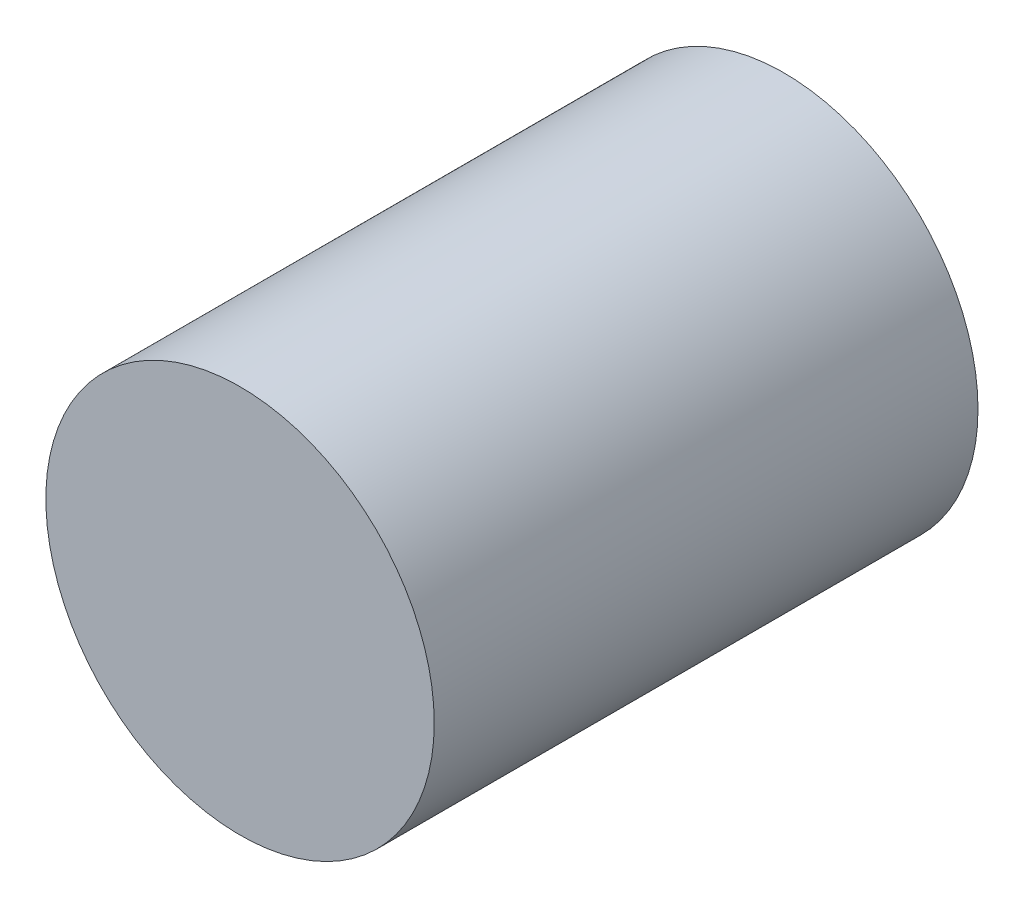
ISO-10303-21;
HEADER;
FILE_DESCRIPTION(('STEP AP214'),'2;1');
FILE_NAME('part.step','',(''),(''),'','','');
FILE_SCHEMA(('AUTOMOTIVE_DESIGN { 1 0 10303 214 1 1 1 1 }'));
ENDSEC;
DATA;
#1=APPLICATION_CONTEXT('core data for automotive mechanical design processes');
#2=APPLICATION_PROTOCOL_DEFINITION('international standard','automotive_design',2000,#1);
#3=PRODUCT_CONTEXT('',#1,'mechanical');
#4=PRODUCT('Part','Part','',(#3));
#5=PRODUCT_RELATED_PRODUCT_CATEGORY('part','',(#4));
#6=PRODUCT_DEFINITION_FORMATION('','',#4);
#7=PRODUCT_DEFINITION_CONTEXT('part definition',#1,'design');
#8=PRODUCT_DEFINITION('design','',#6,#7);
#9=PRODUCT_DEFINITION_SHAPE('','',#8);
#10=(LENGTH_UNIT() NAMED_UNIT(*) SI_UNIT(.MILLI.,.METRE.));
#11=(NAMED_UNIT(*) PLANE_ANGLE_UNIT() SI_UNIT($,.RADIAN.));
#12=(NAMED_UNIT(*) SI_UNIT($,.STERADIAN.) SOLID_ANGLE_UNIT());
#13=UNCERTAINTY_MEASURE_WITH_UNIT(LENGTH_MEASURE(1.E-05),#10,'distance_accuracy_value','');
#14=(GEOMETRIC_REPRESENTATION_CONTEXT(3) GLOBAL_UNCERTAINTY_ASSIGNED_CONTEXT((#13)) GLOBAL_UNIT_ASSIGNED_CONTEXT((#10,
#11,#12)) REPRESENTATION_CONTEXT('',''));
#15=CARTESIAN_POINT('',(0.,0.,0.));
#16=DIRECTION('',(0.,0.,1.));
#17=DIRECTION('',(1.,0.,0.));
#18=AXIS2_PLACEMENT_3D('',#15,#16,#17);
#19=CARTESIAN_POINT('',(0.,0.,140.));
#20=DIRECTION('',(0.,0.,-1.));
#21=DIRECTION('',(-1.,0.,0.));
#22=AXIS2_PLACEMENT_3D('',#19,#20,#21);
#23=CYLINDRICAL_SURFACE('',#22,50.);
#24=CARTESIAN_POINT('',(0.,0.,140.));
#25=DIRECTION('',(0.,0.,1.));
#26=DIRECTION('',(1.,0.,0.));
#27=AXIS2_PLACEMENT_3D('',#24,#25,#26);
#28=CIRCLE('',#27,50.);
#29=CARTESIAN_POINT('',(50.,0.,140.));
#30=VERTEX_POINT('',#29);
#31=EDGE_CURVE('E10',#30,#30,#28,.T.);
#32=ORIENTED_EDGE('',*,*,#31,.F.);
#33=EDGE_LOOP('',(#32));
#34=FACE_BOUND('',#33,.T.);
#35=CARTESIAN_POINT('',(0.,0.,0.));
#36=DIRECTION('',(0.,0.,1.));
#37=DIRECTION('',(1.,0.,0.));
#38=AXIS2_PLACEMENT_3D('',#35,#36,#37);
#39=CIRCLE('',#38,50.);
#40=CARTESIAN_POINT('',(50.,0.,0.));
#41=VERTEX_POINT('',#40);
#42=EDGE_CURVE('E38',#41,#41,#39,.T.);
#43=ORIENTED_EDGE('',*,*,#42,.T.);
#44=EDGE_LOOP('',(#43));
#45=FACE_BOUND('',#44,.T.);
#46=ADVANCED_FACE('F31',(#34,#45),#23,.T.);
#47=CARTESIAN_POINT('',(0.,0.,140.));
#48=DIRECTION('',(0.,0.,1.));
#49=DIRECTION('',(1.,0.,0.));
#50=AXIS2_PLACEMENT_3D('',#47,#48,#49);
#51=PLANE('',#50);
#52=ORIENTED_EDGE('',*,*,#31,.T.);
#53=EDGE_LOOP('',(#52));
#54=FACE_BOUND('',#53,.T.);
#55=ADVANCED_FACE('F75',(#54),#51,.T.);
#56=CARTESIAN_POINT('',(0.,0.,0.));
#57=DIRECTION('',(0.,0.,1.));
#58=DIRECTION('',(1.,0.,0.));
#59=AXIS2_PLACEMENT_3D('',#56,#57,#58);
#60=PLANE('',#59);
#61=CARTESIAN_POINT('',(0.,0.,0.));
#62=DIRECTION('',(0.,0.,-1.));
#63=DIRECTION('',(-1.,0.,0.));
#64=AXIS2_PLACEMENT_3D('',#61,#62,#63);
#65=CIRCLE('',#64,30.);
#66=CARTESIAN_POINT('',(-30.,0.,0.));
#67=VERTEX_POINT('',#66);
#68=EDGE_CURVE('E45',#67,#67,#65,.T.);
#69=ORIENTED_EDGE('',*,*,#68,.F.);
#70=EDGE_LOOP('',(#69));
#71=FACE_BOUND('',#70,.T.);
#72=ORIENTED_EDGE('',*,*,#42,.F.);
#73=EDGE_LOOP('',(#72));
#74=FACE_BOUND('',#73,.T.);
#75=ADVANCED_FACE('F69',(#71,#74),#60,.F.);
#76=CARTESIAN_POINT('',(0.,0.,40.));
#77=DIRECTION('',(0.,0.,-1.));
#78=DIRECTION('',(-1.,0.,0.));
#79=AXIS2_PLACEMENT_3D('',#76,#77,#78);
#80=CYLINDRICAL_SURFACE('',#79,30.);
#81=CARTESIAN_POINT('',(0.,0.,40.));
#82=DIRECTION('',(0.,0.,-1.));
#83=DIRECTION('',(-1.,0.,0.));
#84=AXIS2_PLACEMENT_3D('',#81,#82,#83);
#85=CIRCLE('',#84,30.);
#86=CARTESIAN_POINT('',(-30.,0.,40.));
#87=VERTEX_POINT('',#86);
#88=EDGE_CURVE('E43',#87,#87,#85,.T.);
#89=ORIENTED_EDGE('',*,*,#88,.F.);
#90=EDGE_LOOP('',(#89));
#91=FACE_BOUND('',#90,.T.);
#92=ORIENTED_EDGE('',*,*,#68,.T.);
#93=EDGE_LOOP('',(#92));
#94=FACE_BOUND('',#93,.T.);
#95=ADVANCED_FACE('F63',(#91,#94),#80,.F.);
#96=CARTESIAN_POINT('',(0.,0.,40.));
#97=DIRECTION('',(0.,0.,-1.));
#98=DIRECTION('',(-1.,0.,0.));
#99=AXIS2_PLACEMENT_3D('',#96,#97,#98);
#100=PLANE('',#99);
#101=CARTESIAN_POINT('',(0.,0.,40.));
#102=DIRECTION('',(0.,0.,-1.));
#103=DIRECTION('',(-1.,0.,0.));
#104=AXIS2_PLACEMENT_3D('',#101,#102,#103);
#105=CIRCLE('',#104,10.);
#106=CARTESIAN_POINT('',(-10.,0.,40.));
#107=VERTEX_POINT('',#106);
#108=EDGE_CURVE('E34',#107,#107,#105,.T.);
#109=ORIENTED_EDGE('',*,*,#108,.F.);
#110=EDGE_LOOP('',(#109));
#111=FACE_BOUND('',#110,.T.);
#112=ORIENTED_EDGE('',*,*,#88,.T.);
#113=EDGE_LOOP('',(#112));
#114=FACE_BOUND('',#113,.T.);
#115=ADVANCED_FACE('F60',(#111,#114),#100,.T.);
#116=CARTESIAN_POINT('',(0.,0.,120.));
#117=DIRECTION('',(0.,0.,-1.));
#118=DIRECTION('',(-1.,0.,0.));
#119=AXIS2_PLACEMENT_3D('',#116,#117,#118);
#120=CYLINDRICAL_SURFACE('',#119,10.);
#121=ORIENTED_EDGE('',*,*,#108,.T.);
#122=EDGE_LOOP('',(#121));
#123=FACE_BOUND('',#122,.T.);
#124=CARTESIAN_POINT('',(0.,0.,120.));
#125=DIRECTION('',(0.,0.,-1.));
#126=DIRECTION('',(-1.,0.,0.));
#127=AXIS2_PLACEMENT_3D('',#124,#125,#126);
#128=CIRCLE('',#127,10.);
#129=CARTESIAN_POINT('',(-10.,0.,120.));
#130=VERTEX_POINT('',#129);
#131=EDGE_CURVE('E50',#130,#130,#128,.T.);
#132=ORIENTED_EDGE('',*,*,#131,.F.);
#133=EDGE_LOOP('',(#132));
#134=FACE_BOUND('',#133,.T.);
#135=ADVANCED_FACE('F57',(#123,#134),#120,.F.);
#136=CARTESIAN_POINT('',(0.,0.,120.));
#137=DIRECTION('',(0.,0.,-1.));
#138=DIRECTION('',(-1.,0.,0.));
#139=AXIS2_PLACEMENT_3D('',#136,#137,#138);
#140=PLANE('',#139);
#141=ORIENTED_EDGE('',*,*,#131,.T.);
#142=EDGE_LOOP('',(#141));
#143=FACE_BOUND('',#142,.T.);
#144=ADVANCED_FACE('F89',(#143),#140,.T.);
#145=CLOSED_SHELL('',(#46,#55,#75,#95,#115,#135,#144));
#146=MANIFOLD_SOLID_BREP('B2',#145);
#147=ADVANCED_BREP_SHAPE_REPRESENTATION('',(#18,#146),#14);
#148=SHAPE_DEFINITION_REPRESENTATION(#9,#147);
ENDSEC;
END-ISO-10303-21;
